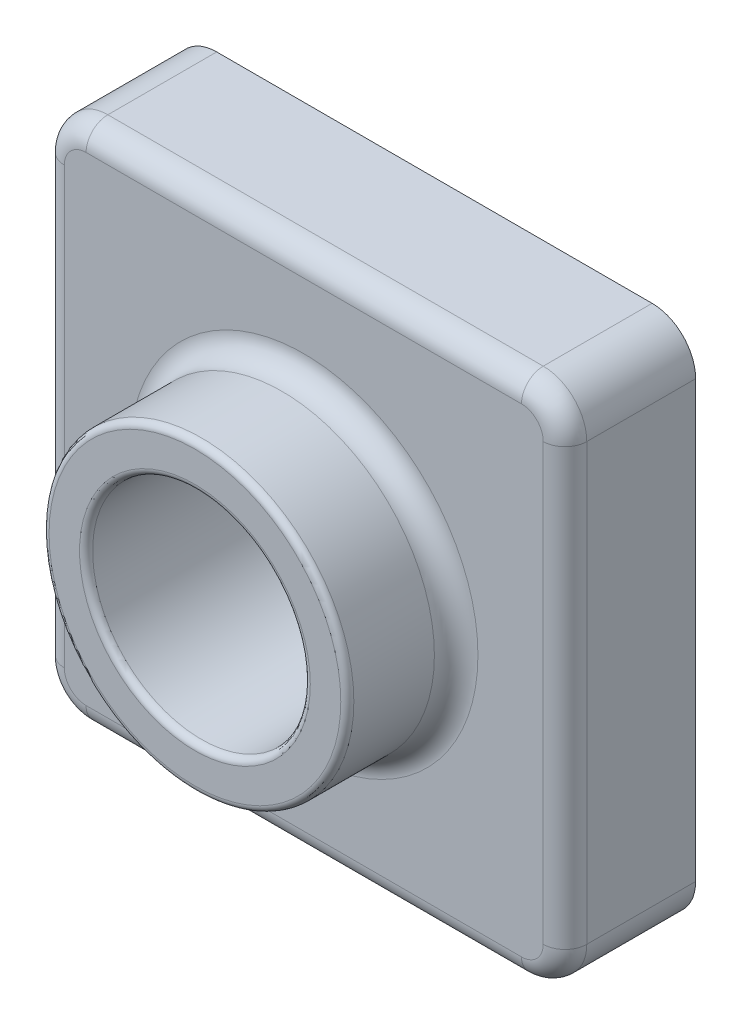
ISO-10303-21;
HEADER;
FILE_DESCRIPTION(('STEP AP214'),'2;1');
FILE_NAME('part.step','',(''),(''),'','','');
FILE_SCHEMA(('AUTOMOTIVE_DESIGN { 1 0 10303 214 1 1 1 1 }'));
ENDSEC;
DATA;
#1=APPLICATION_CONTEXT('core data for automotive mechanical design processes');
#2=APPLICATION_PROTOCOL_DEFINITION('international standard','automotive_design',2000,#1);
#3=PRODUCT_CONTEXT('',#1,'mechanical');
#4=PRODUCT('Part','Part','',(#3));
#5=PRODUCT_RELATED_PRODUCT_CATEGORY('part','',(#4));
#6=PRODUCT_DEFINITION_FORMATION('','',#4);
#7=PRODUCT_DEFINITION_CONTEXT('part definition',#1,'design');
#8=PRODUCT_DEFINITION('design','',#6,#7);
#9=PRODUCT_DEFINITION_SHAPE('','',#8);
#10=(LENGTH_UNIT() NAMED_UNIT(*) SI_UNIT(.MILLI.,.METRE.));
#11=(NAMED_UNIT(*) PLANE_ANGLE_UNIT() SI_UNIT($,.RADIAN.));
#12=(NAMED_UNIT(*) SI_UNIT($,.STERADIAN.) SOLID_ANGLE_UNIT());
#13=UNCERTAINTY_MEASURE_WITH_UNIT(LENGTH_MEASURE(1.E-05),#10,'distance_accuracy_value','');
#14=(GEOMETRIC_REPRESENTATION_CONTEXT(3) GLOBAL_UNCERTAINTY_ASSIGNED_CONTEXT((#13)) GLOBAL_UNIT_ASSIGNED_CONTEXT((#10,
#11,#12)) REPRESENTATION_CONTEXT('',''));
#15=CARTESIAN_POINT('',(0.,0.,0.));
#16=DIRECTION('',(0.,0.,1.));
#17=DIRECTION('',(1.,0.,0.));
#18=AXIS2_PLACEMENT_3D('',#15,#16,#17);
#19=CARTESIAN_POINT('',(0.,0.,0.));
#20=DIRECTION('',(0.,0.,1.));
#21=DIRECTION('',(1.,0.,0.));
#22=AXIS2_PLACEMENT_3D('',#19,#20,#21);
#23=PLANE('',#22);
#24=DIRECTION('',(-1.,0.,0.));
#25=VECTOR('',#24,1.);
#26=CARTESIAN_POINT('',(0.,120.,0.));
#27=LINE('',#26,#25);
#28=CARTESIAN_POINT('',(110.,120.,0.));
#29=VERTEX_POINT('',#28);
#30=CARTESIAN_POINT('',(10.,120.,0.));
#31=VERTEX_POINT('',#30);
#32=EDGE_CURVE('E326',#29,#31,#27,.T.);
#33=ORIENTED_EDGE('',*,*,#32,.F.);
#34=CARTESIAN_POINT('',(110.,110.,0.));
#35=DIRECTION('',(0.,0.,1.));
#36=DIRECTION('',(1.,0.,0.));
#37=AXIS2_PLACEMENT_3D('',#34,#35,#36);
#38=CIRCLE('',#37,10.);
#39=CARTESIAN_POINT('',(120.,110.,0.));
#40=VERTEX_POINT('',#39);
#41=EDGE_CURVE('E412',#29,#40,#38,.F.);
#42=ORIENTED_EDGE('',*,*,#41,.T.);
#43=DIRECTION('',(0.,1.,0.));
#44=VECTOR('',#43,1.);
#45=CARTESIAN_POINT('',(120.,120.,0.));
#46=LINE('',#45,#44);
#47=CARTESIAN_POINT('',(120.,9.99999999999999,0.));
#48=VERTEX_POINT('',#47);
#49=EDGE_CURVE('E322',#48,#40,#46,.T.);
#50=ORIENTED_EDGE('',*,*,#49,.F.);
#51=CARTESIAN_POINT('',(110.,9.99999999999999,0.));
#52=DIRECTION('',(0.,0.,1.));
#53=DIRECTION('',(1.,0.,0.));
#54=AXIS2_PLACEMENT_3D('',#51,#52,#53);
#55=CIRCLE('',#54,10.);
#56=CARTESIAN_POINT('',(110.,0.,0.));
#57=VERTEX_POINT('',#56);
#58=EDGE_CURVE('E403',#48,#57,#55,.F.);
#59=ORIENTED_EDGE('',*,*,#58,.T.);
#60=DIRECTION('',(1.,0.,0.));
#61=VECTOR('',#60,1.);
#62=CARTESIAN_POINT('',(0.,0.,0.));
#63=LINE('',#62,#61);
#64=CARTESIAN_POINT('',(10.,0.,0.));
#65=VERTEX_POINT('',#64);
#66=EDGE_CURVE('E318',#65,#57,#63,.T.);
#67=ORIENTED_EDGE('',*,*,#66,.F.);
#68=CARTESIAN_POINT('',(10.,10.,0.));
#69=DIRECTION('',(0.,0.,1.));
#70=DIRECTION('',(1.,0.,0.));
#71=AXIS2_PLACEMENT_3D('',#68,#69,#70);
#72=CIRCLE('',#71,10.);
#73=CARTESIAN_POINT('',(0.,9.99999999999999,0.));
#74=VERTEX_POINT('',#73);
#75=EDGE_CURVE('E406',#65,#74,#72,.F.);
#76=ORIENTED_EDGE('',*,*,#75,.T.);
#77=DIRECTION('',(0.,-1.,0.));
#78=VECTOR('',#77,1.);
#79=CARTESIAN_POINT('',(0.,120.,0.));
#80=LINE('',#79,#78);
#81=CARTESIAN_POINT('',(0.,110.,0.));
#82=VERTEX_POINT('',#81);
#83=EDGE_CURVE('E313',#82,#74,#80,.T.);
#84=ORIENTED_EDGE('',*,*,#83,.F.);
#85=CARTESIAN_POINT('',(10.,110.,0.));
#86=DIRECTION('',(0.,0.,1.));
#87=DIRECTION('',(1.,0.,0.));
#88=AXIS2_PLACEMENT_3D('',#85,#86,#87);
#89=CIRCLE('',#88,10.);
#90=EDGE_CURVE('E409',#82,#31,#89,.F.);
#91=ORIENTED_EDGE('',*,*,#90,.T.);
#92=EDGE_LOOP('',(#33,#42,#50,#59,#67,#76,#84,#91));
#93=FACE_BOUND('',#92,.T.);
#94=CARTESIAN_POINT('',(110.,110.,0.));
#95=DIRECTION('',(0.,0.,1.));
#96=DIRECTION('',(1.,0.,0.));
#97=AXIS2_PLACEMENT_3D('',#94,#95,#96);
#98=CIRCLE('',#97,8.);
#99=CARTESIAN_POINT('',(110.,118.,0.));
#100=VERTEX_POINT('',#99);
#101=CARTESIAN_POINT('',(118.,110.,0.));
#102=VERTEX_POINT('',#101);
#103=EDGE_CURVE('E274',#100,#102,#98,.F.);
#104=ORIENTED_EDGE('',*,*,#103,.F.);
#105=DIRECTION('',(-1.,0.,0.));
#106=VECTOR('',#105,1.);
#107=CARTESIAN_POINT('',(0.,118.,0.));
#108=LINE('',#107,#106);
#109=CARTESIAN_POINT('',(10.,118.,0.));
#110=VERTEX_POINT('',#109);
#111=EDGE_CURVE('E287',#100,#110,#108,.T.);
#112=ORIENTED_EDGE('',*,*,#111,.T.);
#113=CARTESIAN_POINT('',(10.,110.,0.));
#114=DIRECTION('',(0.,0.,1.));
#115=DIRECTION('',(1.,0.,0.));
#116=AXIS2_PLACEMENT_3D('',#113,#114,#115);
#117=CIRCLE('',#116,8.);
#118=CARTESIAN_POINT('',(2.,110.,0.));
#119=VERTEX_POINT('',#118);
#120=EDGE_CURVE('E283',#119,#110,#117,.F.);
#121=ORIENTED_EDGE('',*,*,#120,.F.);
#122=DIRECTION('',(0.,-1.,0.));
#123=VECTOR('',#122,1.);
#124=CARTESIAN_POINT('',(2.,120.,0.));
#125=LINE('',#124,#123);
#126=CARTESIAN_POINT('',(2.,9.99999999999999,0.));
#127=VERTEX_POINT('',#126);
#128=EDGE_CURVE('E57',#119,#127,#125,.T.);
#129=ORIENTED_EDGE('',*,*,#128,.T.);
#130=CARTESIAN_POINT('',(10.,10.,0.));
#131=DIRECTION('',(0.,0.,1.));
#132=DIRECTION('',(1.,0.,0.));
#133=AXIS2_PLACEMENT_3D('',#130,#131,#132);
#134=CIRCLE('',#133,8.);
#135=CARTESIAN_POINT('',(10.,2.,0.));
#136=VERTEX_POINT('',#135);
#137=EDGE_CURVE('E286',#136,#127,#134,.F.);
#138=ORIENTED_EDGE('',*,*,#137,.F.);
#139=DIRECTION('',(1.,0.,0.));
#140=VECTOR('',#139,1.);
#141=CARTESIAN_POINT('',(0.,2.,0.));
#142=LINE('',#141,#140);
#143=CARTESIAN_POINT('',(110.,2.,0.));
#144=VERTEX_POINT('',#143);
#145=EDGE_CURVE('E281',#136,#144,#142,.T.);
#146=ORIENTED_EDGE('',*,*,#145,.T.);
#147=CARTESIAN_POINT('',(110.,9.99999999999999,0.));
#148=DIRECTION('',(0.,0.,1.));
#149=DIRECTION('',(1.,0.,0.));
#150=AXIS2_PLACEMENT_3D('',#147,#148,#149);
#151=CIRCLE('',#150,8.);
#152=CARTESIAN_POINT('',(118.,9.99999999999999,0.));
#153=VERTEX_POINT('',#152);
#154=EDGE_CURVE('E268',#153,#144,#151,.F.);
#155=ORIENTED_EDGE('',*,*,#154,.F.);
#156=DIRECTION('',(0.,1.,0.));
#157=VECTOR('',#156,1.);
#158=CARTESIAN_POINT('',(118.,120.,0.));
#159=LINE('',#158,#157);
#160=EDGE_CURVE('E292',#153,#102,#159,.T.);
#161=ORIENTED_EDGE('',*,*,#160,.T.);
#162=EDGE_LOOP('',(#104,#112,#121,#129,#138,#146,#155,#161));
#163=FACE_BOUND('',#162,.T.);
#164=ADVANCED_FACE('F41',(#93,#163),#23,.F.);
#165=CARTESIAN_POINT('',(0.,120.,30.));
#166=DIRECTION('',(1.,0.,0.));
#167=DIRECTION('',(0.,0.,-1.));
#168=AXIS2_PLACEMENT_3D('',#165,#166,#167);
#169=PLANE('',#168);
#170=DIRECTION('',(0.,-1.,0.));
#171=VECTOR('',#170,1.);
#172=CARTESIAN_POINT('',(0.,120.,25.));
#173=LINE('',#172,#171);
#174=CARTESIAN_POINT('',(0.,10.,25.));
#175=VERTEX_POINT('',#174);
#176=CARTESIAN_POINT('',(0.,110.,25.));
#177=VERTEX_POINT('',#176);
#178=EDGE_CURVE('E65',#175,#177,#173,.F.);
#179=ORIENTED_EDGE('',*,*,#178,.T.);
#180=DIRECTION('',(0.,0.,-1.));
#181=VECTOR('',#180,1.);
#182=CARTESIAN_POINT('',(0.,110.,30.));
#183=LINE('',#182,#181);
#184=EDGE_CURVE('E396',#177,#82,#183,.T.);
#185=ORIENTED_EDGE('',*,*,#184,.T.);
#186=ORIENTED_EDGE('',*,*,#83,.T.);
#187=DIRECTION('',(0.,0.,-1.));
#188=VECTOR('',#187,1.);
#189=CARTESIAN_POINT('',(0.,9.99999999999999,30.));
#190=LINE('',#189,#188);
#191=EDGE_CURVE('E391',#74,#175,#190,.F.);
#192=ORIENTED_EDGE('',*,*,#191,.T.);
#193=EDGE_LOOP('',(#179,#185,#186,#192));
#194=FACE_BOUND('',#193,.T.);
#195=ADVANCED_FACE('F512',(#194),#169,.F.);
#196=CARTESIAN_POINT('',(0.,0.,30.));
#197=DIRECTION('',(0.,1.,0.));
#198=DIRECTION('',(0.,0.,1.));
#199=AXIS2_PLACEMENT_3D('',#196,#197,#198);
#200=PLANE('',#199);
#201=DIRECTION('',(1.,0.,0.));
#202=VECTOR('',#201,1.);
#203=CARTESIAN_POINT('',(0.,0.,25.));
#204=LINE('',#203,#202);
#205=CARTESIAN_POINT('',(110.,0.,25.));
#206=VERTEX_POINT('',#205);
#207=CARTESIAN_POINT('',(10.,0.,25.));
#208=VERTEX_POINT('',#207);
#209=EDGE_CURVE('E385',#206,#208,#204,.F.);
#210=ORIENTED_EDGE('',*,*,#209,.T.);
#211=DIRECTION('',(0.,0.,-1.));
#212=VECTOR('',#211,1.);
#213=CARTESIAN_POINT('',(10.,0.,30.));
#214=LINE('',#213,#212);
#215=EDGE_CURVE('E388',#208,#65,#214,.T.);
#216=ORIENTED_EDGE('',*,*,#215,.T.);
#217=ORIENTED_EDGE('',*,*,#66,.T.);
#218=DIRECTION('',(0.,0.,-1.));
#219=VECTOR('',#218,1.);
#220=CARTESIAN_POINT('',(110.,0.,30.));
#221=LINE('',#220,#219);
#222=EDGE_CURVE('E382',#57,#206,#221,.F.);
#223=ORIENTED_EDGE('',*,*,#222,.T.);
#224=EDGE_LOOP('',(#210,#216,#217,#223));
#225=FACE_BOUND('',#224,.T.);
#226=ADVANCED_FACE('F517',(#225),#200,.F.);
#227=CARTESIAN_POINT('',(120.,120.,30.));
#228=DIRECTION('',(-1.,0.,0.));
#229=DIRECTION('',(0.,0.,1.));
#230=AXIS2_PLACEMENT_3D('',#227,#228,#229);
#231=PLANE('',#230);
#232=ORIENTED_EDGE('',*,*,#49,.T.);
#233=DIRECTION('',(0.,0.,-1.));
#234=VECTOR('',#233,1.);
#235=CARTESIAN_POINT('',(120.,110.,30.));
#236=LINE('',#235,#234);
#237=CARTESIAN_POINT('',(120.,110.,25.));
#238=VERTEX_POINT('',#237);
#239=EDGE_CURVE('E379',#40,#238,#236,.F.);
#240=ORIENTED_EDGE('',*,*,#239,.T.);
#241=DIRECTION('',(0.,1.,0.));
#242=VECTOR('',#241,1.);
#243=CARTESIAN_POINT('',(120.,0.,25.));
#244=LINE('',#243,#242);
#245=CARTESIAN_POINT('',(120.,9.99999999999999,25.));
#246=VERTEX_POINT('',#245);
#247=EDGE_CURVE('E376',#238,#246,#244,.F.);
#248=ORIENTED_EDGE('',*,*,#247,.T.);
#249=DIRECTION('',(0.,0.,-1.));
#250=VECTOR('',#249,1.);
#251=CARTESIAN_POINT('',(120.,9.99999999999999,30.));
#252=LINE('',#251,#250);
#253=EDGE_CURVE('E373',#246,#48,#252,.T.);
#254=ORIENTED_EDGE('',*,*,#253,.T.);
#255=EDGE_LOOP('',(#232,#240,#248,#254));
#256=FACE_BOUND('',#255,.T.);
#257=ADVANCED_FACE('F962',(#256),#231,.F.);
#258=CARTESIAN_POINT('',(0.,120.,30.));
#259=DIRECTION('',(0.,-1.,0.));
#260=DIRECTION('',(0.,0.,-1.));
#261=AXIS2_PLACEMENT_3D('',#258,#259,#260);
#262=PLANE('',#261);
#263=DIRECTION('',(-1.,0.,0.));
#264=VECTOR('',#263,1.);
#265=CARTESIAN_POINT('',(120.,120.,25.));
#266=LINE('',#265,#264);
#267=CARTESIAN_POINT('',(10.,120.,25.));
#268=VERTEX_POINT('',#267);
#269=CARTESIAN_POINT('',(110.,120.,25.));
#270=VERTEX_POINT('',#269);
#271=EDGE_CURVE('E366',#268,#270,#266,.F.);
#272=ORIENTED_EDGE('',*,*,#271,.T.);
#273=DIRECTION('',(0.,0.,-1.));
#274=VECTOR('',#273,1.);
#275=CARTESIAN_POINT('',(110.,120.,30.));
#276=LINE('',#275,#274);
#277=EDGE_CURVE('E370',#270,#29,#276,.T.);
#278=ORIENTED_EDGE('',*,*,#277,.T.);
#279=ORIENTED_EDGE('',*,*,#32,.T.);
#280=DIRECTION('',(0.,0.,-1.));
#281=VECTOR('',#280,1.);
#282=CARTESIAN_POINT('',(10.,120.,30.));
#283=LINE('',#282,#281);
#284=EDGE_CURVE('E363',#31,#268,#283,.F.);
#285=ORIENTED_EDGE('',*,*,#284,.T.);
#286=EDGE_LOOP('',(#272,#278,#279,#285));
#287=FACE_BOUND('',#286,.T.);
#288=ADVANCED_FACE('F506',(#287),#262,.F.);
#289=CARTESIAN_POINT('',(0.,0.,30.));
#290=DIRECTION('',(0.,0.,1.));
#291=DIRECTION('',(1.,0.,0.));
#292=AXIS2_PLACEMENT_3D('',#289,#290,#291);
#293=PLANE('',#292);
#294=CARTESIAN_POINT('',(110.,9.99999999999999,30.));
#295=DIRECTION('',(0.,0.,1.));
#296=DIRECTION('',(1.,0.,0.));
#297=AXIS2_PLACEMENT_3D('',#294,#295,#296);
#298=CIRCLE('',#297,5.);
#299=CARTESIAN_POINT('',(115.,9.99999999999999,30.));
#300=VERTEX_POINT('',#299);
#301=CARTESIAN_POINT('',(110.,5.,30.));
#302=VERTEX_POINT('',#301);
#303=EDGE_CURVE('E352',#300,#302,#298,.F.);
#304=ORIENTED_EDGE('',*,*,#303,.F.);
#305=DIRECTION('',(0.,1.,0.));
#306=VECTOR('',#305,1.);
#307=CARTESIAN_POINT('',(115.,120.,30.));
#308=LINE('',#307,#306);
#309=CARTESIAN_POINT('',(115.,110.,30.));
#310=VERTEX_POINT('',#309);
#311=EDGE_CURVE('E360',#300,#310,#308,.T.);
#312=ORIENTED_EDGE('',*,*,#311,.T.);
#313=CARTESIAN_POINT('',(110.,110.,30.));
#314=DIRECTION('',(0.,0.,1.));
#315=DIRECTION('',(1.,0.,0.));
#316=AXIS2_PLACEMENT_3D('',#313,#314,#315);
#317=CIRCLE('',#316,5.);
#318=CARTESIAN_POINT('',(110.,115.,30.));
#319=VERTEX_POINT('',#318);
#320=EDGE_CURVE('E356',#319,#310,#317,.F.);
#321=ORIENTED_EDGE('',*,*,#320,.F.);
#322=DIRECTION('',(-1.,0.,0.));
#323=VECTOR('',#322,1.);
#324=CARTESIAN_POINT('',(0.,115.,30.));
#325=LINE('',#324,#323);
#326=CARTESIAN_POINT('',(10.,115.,30.));
#327=VERTEX_POINT('',#326);
#328=EDGE_CURVE('E348',#319,#327,#325,.T.);
#329=ORIENTED_EDGE('',*,*,#328,.T.);
#330=CARTESIAN_POINT('',(10.,110.,30.));
#331=DIRECTION('',(0.,0.,1.));
#332=DIRECTION('',(1.,0.,0.));
#333=AXIS2_PLACEMENT_3D('',#330,#331,#332);
#334=CIRCLE('',#333,5.);
#335=CARTESIAN_POINT('',(5.,110.,30.));
#336=VERTEX_POINT('',#335);
#337=EDGE_CURVE('E344',#336,#327,#334,.F.);
#338=ORIENTED_EDGE('',*,*,#337,.F.);
#339=DIRECTION('',(0.,-1.,0.));
#340=VECTOR('',#339,1.);
#341=CARTESIAN_POINT('',(5.,0.,30.));
#342=LINE('',#341,#340);
#343=CARTESIAN_POINT('',(5.,10.,30.));
#344=VERTEX_POINT('',#343);
#345=EDGE_CURVE('E338',#336,#344,#342,.T.);
#346=ORIENTED_EDGE('',*,*,#345,.T.);
#347=CARTESIAN_POINT('',(10.,10.,30.));
#348=DIRECTION('',(0.,0.,1.));
#349=DIRECTION('',(1.,0.,0.));
#350=AXIS2_PLACEMENT_3D('',#347,#348,#349);
#351=CIRCLE('',#350,5.);
#352=CARTESIAN_POINT('',(10.,5.,30.));
#353=VERTEX_POINT('',#352);
#354=EDGE_CURVE('E334',#353,#344,#351,.F.);
#355=ORIENTED_EDGE('',*,*,#354,.F.);
#356=DIRECTION('',(1.,0.,0.));
#357=VECTOR('',#356,1.);
#358=CARTESIAN_POINT('',(120.,5.,30.));
#359=LINE('',#358,#357);
#360=EDGE_CURVE('E341',#353,#302,#359,.T.);
#361=ORIENTED_EDGE('',*,*,#360,.T.);
#362=EDGE_LOOP('',(#304,#312,#321,#329,#338,#346,#355,#361));
#363=FACE_BOUND('',#362,.T.);
#364=CARTESIAN_POINT('',(60.,60.,30.));
#365=DIRECTION('',(0.,0.,1.));
#366=DIRECTION('',(1.,0.,0.));
#367=AXIS2_PLACEMENT_3D('',#364,#365,#366);
#368=CIRCLE('',#367,40.);
#369=CARTESIAN_POINT('',(100.,60.,30.));
#370=VERTEX_POINT('',#369);
#371=EDGE_CURVE('E330',#370,#370,#368,.F.);
#372=ORIENTED_EDGE('',*,*,#371,.T.);
#373=EDGE_LOOP('',(#372));
#374=FACE_BOUND('',#373,.T.);
#375=ADVANCED_FACE('F498',(#363,#374),#293,.T.);
#376=CARTESIAN_POINT('',(60.,60.,0.));
#377=DIRECTION('',(0.,0.,1.));
#378=DIRECTION('',(1.,0.,0.));
#379=AXIS2_PLACEMENT_3D('',#376,#377,#378);
#380=CIRCLE('',#379,27.);
#381=CARTESIAN_POINT('',(87.,60.,0.));
#382=VERTEX_POINT('',#381);
#383=EDGE_CURVE('E282',#382,#382,#380,.T.);
#384=ORIENTED_EDGE('',*,*,#383,.F.);
#385=EDGE_LOOP('',(#384));
#386=FACE_BOUND('',#385,.T.);
#387=CARTESIAN_POINT('',(60.,60.,0.));
#388=DIRECTION('',(0.,0.,1.));
#389=DIRECTION('',(1.,0.,0.));
#390=AXIS2_PLACEMENT_3D('',#387,#388,#389);
#391=CIRCLE('',#390,25.);
#392=CARTESIAN_POINT('',(85.,60.,0.));
#393=VERTEX_POINT('',#392);
#394=EDGE_CURVE('E309',#393,#393,#391,.T.);
#395=ORIENTED_EDGE('',*,*,#394,.T.);
#396=EDGE_LOOP('',(#395));
#397=FACE_BOUND('',#396,.T.);
#398=ADVANCED_FACE('F496',(#386,#397),#23,.F.);
#399=CARTESIAN_POINT('',(60.,60.,55.));
#400=DIRECTION('',(0.,0.,-1.));
#401=DIRECTION('',(-1.,0.,0.));
#402=AXIS2_PLACEMENT_3D('',#399,#400,#401);
#403=CYLINDRICAL_SURFACE('',#402,35.);
#404=CARTESIAN_POINT('',(60.,60.,53.5));
#405=DIRECTION('',(0.,0.,1.));
#406=DIRECTION('',(1.,0.,0.));
#407=AXIS2_PLACEMENT_3D('',#404,#405,#406);
#408=CIRCLE('',#407,35.);
#409=CARTESIAN_POINT('',(95.,60.,53.5));
#410=VERTEX_POINT('',#409);
#411=EDGE_CURVE('E50',#410,#410,#408,.F.);
#412=ORIENTED_EDGE('',*,*,#411,.T.);
#413=EDGE_LOOP('',(#412));
#414=FACE_BOUND('',#413,.T.);
#415=CARTESIAN_POINT('',(60.,60.,35.));
#416=DIRECTION('',(0.,0.,1.));
#417=DIRECTION('',(1.,0.,0.));
#418=AXIS2_PLACEMENT_3D('',#415,#416,#417);
#419=CIRCLE('',#418,35.);
#420=CARTESIAN_POINT('',(95.,60.,35.));
#421=VERTEX_POINT('',#420);
#422=EDGE_CURVE('E399',#421,#421,#419,.T.);
#423=ORIENTED_EDGE('',*,*,#422,.T.);
#424=EDGE_LOOP('',(#423));
#425=FACE_BOUND('',#424,.T.);
#426=ADVANCED_FACE('F470',(#414,#425),#403,.T.);
#427=CARTESIAN_POINT('',(60.,60.,55.));
#428=DIRECTION('',(0.,0.,1.));
#429=DIRECTION('',(1.,0.,0.));
#430=AXIS2_PLACEMENT_3D('',#427,#428,#429);
#431=PLANE('',#430);
#432=CARTESIAN_POINT('',(60.,60.,55.));
#433=DIRECTION('',(0.,0.,1.));
#434=DIRECTION('',(1.,0.,0.));
#435=AXIS2_PLACEMENT_3D('',#432,#433,#434);
#436=CIRCLE('',#435,33.5);
#437=CARTESIAN_POINT('',(93.5,60.,55.));
#438=VERTEX_POINT('',#437);
#439=EDGE_CURVE('E463',#438,#438,#436,.T.);
#440=ORIENTED_EDGE('',*,*,#439,.T.);
#441=EDGE_LOOP('',(#440));
#442=FACE_BOUND('',#441,.T.);
#443=CARTESIAN_POINT('',(60.,60.,55.));
#444=DIRECTION('',(0.,0.,1.));
#445=DIRECTION('',(1.,0.,0.));
#446=AXIS2_PLACEMENT_3D('',#443,#444,#445);
#447=CIRCLE('',#446,26.5);
#448=CARTESIAN_POINT('',(86.5,60.,55.));
#449=VERTEX_POINT('',#448);
#450=EDGE_CURVE('E415',#449,#449,#447,.F.);
#451=ORIENTED_EDGE('',*,*,#450,.T.);
#452=EDGE_LOOP('',(#451));
#453=FACE_BOUND('',#452,.T.);
#454=ADVANCED_FACE('F479',(#442,#453),#431,.T.);
#455=CARTESIAN_POINT('',(60.,60.,0.));
#456=DIRECTION('',(0.,0.,1.));
#457=DIRECTION('',(1.,0.,0.));
#458=AXIS2_PLACEMENT_3D('',#455,#456,#457);
#459=CYLINDRICAL_SURFACE('',#458,25.);
#460=CARTESIAN_POINT('',(60.,60.,53.5));
#461=DIRECTION('',(0.,0.,1.));
#462=DIRECTION('',(1.,0.,0.));
#463=AXIS2_PLACEMENT_3D('',#460,#461,#462);
#464=CIRCLE('',#463,25.);
#465=CARTESIAN_POINT('',(85.,60.,53.5));
#466=VERTEX_POINT('',#465);
#467=EDGE_CURVE('E12',#466,#466,#464,.T.);
#468=ORIENTED_EDGE('',*,*,#467,.T.);
#469=EDGE_LOOP('',(#468));
#470=FACE_BOUND('',#469,.T.);
#471=ORIENTED_EDGE('',*,*,#394,.F.);
#472=EDGE_LOOP('',(#471));
#473=FACE_BOUND('',#472,.T.);
#474=ADVANCED_FACE('F482',(#470,#473),#459,.F.);
#475=CARTESIAN_POINT('',(110.,9.99999999999999,30.));
#476=DIRECTION('',(0.,0.,-1.));
#477=DIRECTION('',(-1.,0.,0.));
#478=AXIS2_PLACEMENT_3D('',#475,#476,#477);
#479=CYLINDRICAL_SURFACE('',#478,10.);
#480=ORIENTED_EDGE('',*,*,#58,.F.);
#481=ORIENTED_EDGE('',*,*,#253,.F.);
#482=CARTESIAN_POINT('',(110.,9.99999999999999,25.));
#483=DIRECTION('',(0.,0.,1.));
#484=DIRECTION('',(1.,0.,0.));
#485=AXIS2_PLACEMENT_3D('',#482,#483,#484);
#486=CIRCLE('',#485,10.);
#487=EDGE_CURVE('E314',#206,#246,#486,.T.);
#488=ORIENTED_EDGE('',*,*,#487,.F.);
#489=ORIENTED_EDGE('',*,*,#222,.F.);
#490=EDGE_LOOP('',(#480,#481,#488,#489));
#491=FACE_BOUND('',#490,.T.);
#492=ADVANCED_FACE('F492',(#491),#479,.T.);
#493=CARTESIAN_POINT('',(0.,5.,25.));
#494=DIRECTION('',(-1.,0.,0.));
#495=DIRECTION('',(0.,0.,1.));
#496=AXIS2_PLACEMENT_3D('',#493,#494,#495);
#497=CYLINDRICAL_SURFACE('',#496,5.);
#498=CARTESIAN_POINT('',(10.,5.,25.));
#499=DIRECTION('',(-1.,0.,0.));
#500=DIRECTION('',(0.,0.,1.));
#501=AXIS2_PLACEMENT_3D('',#498,#499,#500);
#502=CIRCLE('',#501,5.);
#503=EDGE_CURVE('E449',#208,#353,#502,.T.);
#504=ORIENTED_EDGE('',*,*,#503,.F.);
#505=ORIENTED_EDGE('',*,*,#209,.F.);
#506=CARTESIAN_POINT('',(110.,5.,25.));
#507=DIRECTION('',(1.,0.,0.));
#508=DIRECTION('',(0.,0.,-1.));
#509=AXIS2_PLACEMENT_3D('',#506,#507,#508);
#510=CIRCLE('',#509,5.);
#511=EDGE_CURVE('E453',#302,#206,#510,.T.);
#512=ORIENTED_EDGE('',*,*,#511,.F.);
#513=ORIENTED_EDGE('',*,*,#360,.F.);
#514=EDGE_LOOP('',(#504,#505,#512,#513));
#515=FACE_BOUND('',#514,.T.);
#516=ADVANCED_FACE('F931',(#515),#497,.T.);
#517=CARTESIAN_POINT('',(10.,10.,30.));
#518=DIRECTION('',(0.,0.,-1.));
#519=DIRECTION('',(-1.,0.,0.));
#520=AXIS2_PLACEMENT_3D('',#517,#518,#519);
#521=CYLINDRICAL_SURFACE('',#520,10.);
#522=ORIENTED_EDGE('',*,*,#75,.F.);
#523=ORIENTED_EDGE('',*,*,#215,.F.);
#524=CARTESIAN_POINT('',(10.,10.,25.));
#525=DIRECTION('',(0.,0.,1.));
#526=DIRECTION('',(1.,0.,0.));
#527=AXIS2_PLACEMENT_3D('',#524,#525,#526);
#528=CIRCLE('',#527,10.);
#529=EDGE_CURVE('E445',#175,#208,#528,.T.);
#530=ORIENTED_EDGE('',*,*,#529,.F.);
#531=ORIENTED_EDGE('',*,*,#191,.F.);
#532=EDGE_LOOP('',(#522,#523,#530,#531));
#533=FACE_BOUND('',#532,.T.);
#534=ADVANCED_FACE('F921',(#533),#521,.T.);
#535=CARTESIAN_POINT('',(110.,9.99999999999999,25.));
#536=DIRECTION('',(0.,0.,1.));
#537=DIRECTION('',(1.,0.,0.));
#538=AXIS2_PLACEMENT_3D('',#535,#536,#537);
#539=DEGENERATE_TOROIDAL_SURFACE('',#538,5.,5.,.T.);
#540=ORIENTED_EDGE('',*,*,#511,.T.);
#541=ORIENTED_EDGE('',*,*,#487,.T.);
#542=CARTESIAN_POINT('',(115.,9.99999999999999,25.));
#543=DIRECTION('',(0.,-1.,0.));
#544=DIRECTION('',(0.,0.,-1.));
#545=AXIS2_PLACEMENT_3D('',#542,#543,#544);
#546=CIRCLE('',#545,5.);
#547=EDGE_CURVE('E441',#300,#246,#546,.F.);
#548=ORIENTED_EDGE('',*,*,#547,.F.);
#549=ORIENTED_EDGE('',*,*,#303,.T.);
#550=EDGE_LOOP('',(#540,#541,#548,#549));
#551=FACE_BOUND('',#550,.T.);
#552=ADVANCED_FACE('F911',(#551),#539,.T.);
#553=CARTESIAN_POINT('',(10.,10.,25.));
#554=DIRECTION('',(0.,0.,1.));
#555=DIRECTION('',(1.,0.,0.));
#556=AXIS2_PLACEMENT_3D('',#553,#554,#555);
#557=DEGENERATE_TOROIDAL_SURFACE('',#556,5.,5.,.T.);
#558=ORIENTED_EDGE('',*,*,#503,.T.);
#559=ORIENTED_EDGE('',*,*,#354,.T.);
#560=CARTESIAN_POINT('',(5.,10.,25.));
#561=DIRECTION('',(0.,-1.,0.));
#562=DIRECTION('',(0.,0.,-1.));
#563=AXIS2_PLACEMENT_3D('',#560,#561,#562);
#564=CIRCLE('',#563,5.);
#565=EDGE_CURVE('E437',#175,#344,#564,.F.);
#566=ORIENTED_EDGE('',*,*,#565,.F.);
#567=ORIENTED_EDGE('',*,*,#529,.T.);
#568=EDGE_LOOP('',(#558,#559,#566,#567));
#569=FACE_BOUND('',#568,.T.);
#570=ADVANCED_FACE('F901',(#569),#557,.T.);
#571=CARTESIAN_POINT('',(110.,110.,30.));
#572=DIRECTION('',(0.,0.,-1.));
#573=DIRECTION('',(-1.,0.,0.));
#574=AXIS2_PLACEMENT_3D('',#571,#572,#573);
#575=CYLINDRICAL_SURFACE('',#574,10.);
#576=ORIENTED_EDGE('',*,*,#41,.F.);
#577=ORIENTED_EDGE('',*,*,#277,.F.);
#578=CARTESIAN_POINT('',(110.,110.,25.));
#579=DIRECTION('',(0.,0.,1.));
#580=DIRECTION('',(1.,0.,0.));
#581=AXIS2_PLACEMENT_3D('',#578,#579,#580);
#582=CIRCLE('',#581,10.);
#583=EDGE_CURVE('E433',#238,#270,#582,.T.);
#584=ORIENTED_EDGE('',*,*,#583,.F.);
#585=ORIENTED_EDGE('',*,*,#239,.F.);
#586=EDGE_LOOP('',(#576,#577,#584,#585));
#587=FACE_BOUND('',#586,.T.);
#588=ADVANCED_FACE('F891',(#587),#575,.T.);
#589=CARTESIAN_POINT('',(115.,0.,25.));
#590=DIRECTION('',(0.,-1.,0.));
#591=DIRECTION('',(0.,0.,-1.));
#592=AXIS2_PLACEMENT_3D('',#589,#590,#591);
#593=CYLINDRICAL_SURFACE('',#592,5.);
#594=ORIENTED_EDGE('',*,*,#547,.T.);
#595=ORIENTED_EDGE('',*,*,#247,.F.);
#596=CARTESIAN_POINT('',(115.,110.,25.));
#597=DIRECTION('',(0.,1.,0.));
#598=DIRECTION('',(0.,0.,1.));
#599=AXIS2_PLACEMENT_3D('',#596,#597,#598);
#600=CIRCLE('',#599,5.);
#601=EDGE_CURVE('E429',#310,#238,#600,.T.);
#602=ORIENTED_EDGE('',*,*,#601,.F.);
#603=ORIENTED_EDGE('',*,*,#311,.F.);
#604=EDGE_LOOP('',(#594,#595,#602,#603));
#605=FACE_BOUND('',#604,.T.);
#606=ADVANCED_FACE('F881',(#605),#593,.T.);
#607=CARTESIAN_POINT('',(5.,0.,25.));
#608=DIRECTION('',(0.,1.,0.));
#609=DIRECTION('',(0.,0.,1.));
#610=AXIS2_PLACEMENT_3D('',#607,#608,#609);
#611=CYLINDRICAL_SURFACE('',#610,5.);
#612=ORIENTED_EDGE('',*,*,#565,.T.);
#613=ORIENTED_EDGE('',*,*,#345,.F.);
#614=CARTESIAN_POINT('',(5.,110.,25.));
#615=DIRECTION('',(0.,1.,0.));
#616=DIRECTION('',(0.,0.,1.));
#617=AXIS2_PLACEMENT_3D('',#614,#615,#616);
#618=CIRCLE('',#617,5.);
#619=EDGE_CURVE('E425',#177,#336,#618,.T.);
#620=ORIENTED_EDGE('',*,*,#619,.F.);
#621=ORIENTED_EDGE('',*,*,#178,.F.);
#622=EDGE_LOOP('',(#612,#613,#620,#621));
#623=FACE_BOUND('',#622,.T.);
#624=ADVANCED_FACE('F871',(#623),#611,.T.);
#625=CARTESIAN_POINT('',(10.,110.,30.));
#626=DIRECTION('',(0.,0.,-1.));
#627=DIRECTION('',(-1.,0.,0.));
#628=AXIS2_PLACEMENT_3D('',#625,#626,#627);
#629=CYLINDRICAL_SURFACE('',#628,10.);
#630=ORIENTED_EDGE('',*,*,#90,.F.);
#631=ORIENTED_EDGE('',*,*,#184,.F.);
#632=CARTESIAN_POINT('',(10.,110.,25.));
#633=DIRECTION('',(0.,0.,1.));
#634=DIRECTION('',(1.,0.,0.));
#635=AXIS2_PLACEMENT_3D('',#632,#633,#634);
#636=CIRCLE('',#635,10.);
#637=EDGE_CURVE('E421',#268,#177,#636,.T.);
#638=ORIENTED_EDGE('',*,*,#637,.F.);
#639=ORIENTED_EDGE('',*,*,#284,.F.);
#640=EDGE_LOOP('',(#630,#631,#638,#639));
#641=FACE_BOUND('',#640,.T.);
#642=ADVANCED_FACE('F861',(#641),#629,.T.);
#643=CARTESIAN_POINT('',(110.,110.,25.));
#644=DIRECTION('',(0.,0.,1.));
#645=DIRECTION('',(1.,0.,0.));
#646=AXIS2_PLACEMENT_3D('',#643,#644,#645);
#647=DEGENERATE_TOROIDAL_SURFACE('',#646,5.,5.,.T.);
#648=ORIENTED_EDGE('',*,*,#601,.T.);
#649=ORIENTED_EDGE('',*,*,#583,.T.);
#650=CARTESIAN_POINT('',(110.,115.,25.));
#651=DIRECTION('',(1.,0.,0.));
#652=DIRECTION('',(0.,0.,-1.));
#653=AXIS2_PLACEMENT_3D('',#650,#651,#652);
#654=CIRCLE('',#653,5.);
#655=EDGE_CURVE('E418',#319,#270,#654,.F.);
#656=ORIENTED_EDGE('',*,*,#655,.F.);
#657=ORIENTED_EDGE('',*,*,#320,.T.);
#658=EDGE_LOOP('',(#648,#649,#656,#657));
#659=FACE_BOUND('',#658,.T.);
#660=ADVANCED_FACE('F851',(#659),#647,.T.);
#661=CARTESIAN_POINT('',(10.,110.,25.));
#662=DIRECTION('',(0.,0.,1.));
#663=DIRECTION('',(1.,0.,0.));
#664=AXIS2_PLACEMENT_3D('',#661,#662,#663);
#665=DEGENERATE_TOROIDAL_SURFACE('',#664,5.,5.,.T.);
#666=ORIENTED_EDGE('',*,*,#619,.T.);
#667=ORIENTED_EDGE('',*,*,#337,.T.);
#668=CARTESIAN_POINT('',(10.,115.,25.));
#669=DIRECTION('',(-1.,0.,0.));
#670=DIRECTION('',(0.,0.,1.));
#671=AXIS2_PLACEMENT_3D('',#668,#669,#670);
#672=CIRCLE('',#671,5.);
#673=EDGE_CURVE('E278',#268,#327,#672,.F.);
#674=ORIENTED_EDGE('',*,*,#673,.F.);
#675=ORIENTED_EDGE('',*,*,#637,.T.);
#676=EDGE_LOOP('',(#666,#667,#674,#675));
#677=FACE_BOUND('',#676,.T.);
#678=ADVANCED_FACE('F841',(#677),#665,.T.);
#679=CARTESIAN_POINT('',(0.,115.,25.));
#680=DIRECTION('',(1.,0.,0.));
#681=DIRECTION('',(0.,0.,-1.));
#682=AXIS2_PLACEMENT_3D('',#679,#680,#681);
#683=CYLINDRICAL_SURFACE('',#682,5.);
#684=ORIENTED_EDGE('',*,*,#655,.T.);
#685=ORIENTED_EDGE('',*,*,#271,.F.);
#686=ORIENTED_EDGE('',*,*,#673,.T.);
#687=ORIENTED_EDGE('',*,*,#328,.F.);
#688=EDGE_LOOP('',(#684,#685,#686,#687));
#689=FACE_BOUND('',#688,.T.);
#690=ADVANCED_FACE('F831',(#689),#683,.T.);
#691=CARTESIAN_POINT('',(60.,60.,35.));
#692=DIRECTION('',(0.,0.,1.));
#693=DIRECTION('',(1.,0.,0.));
#694=AXIS2_PLACEMENT_3D('',#691,#692,#693);
#695=TOROIDAL_SURFACE('',#694,40.,5.);
#696=ORIENTED_EDGE('',*,*,#371,.F.);
#697=EDGE_LOOP('',(#696));
#698=FACE_BOUND('',#697,.T.);
#699=ORIENTED_EDGE('',*,*,#422,.F.);
#700=EDGE_LOOP('',(#699));
#701=FACE_BOUND('',#700,.T.);
#702=ADVANCED_FACE('F476',(#698,#701),#695,.F.);
#703=CARTESIAN_POINT('',(60.,60.,53.5));
#704=DIRECTION('',(0.,0.,1.));
#705=DIRECTION('',(1.,0.,0.));
#706=AXIS2_PLACEMENT_3D('',#703,#704,#705);
#707=TOROIDAL_SURFACE('',#706,33.5,1.5);
#708=ORIENTED_EDGE('',*,*,#411,.F.);
#709=EDGE_LOOP('',(#708));
#710=FACE_BOUND('',#709,.T.);
#711=ORIENTED_EDGE('',*,*,#439,.F.);
#712=EDGE_LOOP('',(#711));
#713=FACE_BOUND('',#712,.T.);
#714=ADVANCED_FACE('F473',(#710,#713),#707,.T.);
#715=CARTESIAN_POINT('',(60.,60.,53.5));
#716=DIRECTION('',(0.,0.,1.));
#717=DIRECTION('',(1.,0.,0.));
#718=AXIS2_PLACEMENT_3D('',#715,#716,#717);
#719=TOROIDAL_SURFACE('',#718,26.5,1.5);
#720=ORIENTED_EDGE('',*,*,#450,.F.);
#721=EDGE_LOOP('',(#720));
#722=FACE_BOUND('',#721,.T.);
#723=ORIENTED_EDGE('',*,*,#467,.F.);
#724=EDGE_LOOP('',(#723));
#725=FACE_BOUND('',#724,.T.);
#726=ADVANCED_FACE('F43',(#722,#725),#719,.T.);
#727=CARTESIAN_POINT('',(2.,120.,30.));
#728=DIRECTION('',(1.,0.,0.));
#729=DIRECTION('',(0.,0.,-1.));
#730=AXIS2_PLACEMENT_3D('',#727,#728,#729);
#731=PLANE('',#730);
#732=DIRECTION('',(0.,1.,0.));
#733=VECTOR('',#732,1.);
#734=CARTESIAN_POINT('',(2.,120.,25.));
#735=LINE('',#734,#733);
#736=CARTESIAN_POINT('',(2.,9.99999999999999,25.));
#737=VERTEX_POINT('',#736);
#738=CARTESIAN_POINT('',(2.,110.,25.));
#739=VERTEX_POINT('',#738);
#740=EDGE_CURVE('E206',#737,#739,#735,.T.);
#741=ORIENTED_EDGE('',*,*,#740,.F.);
#742=DIRECTION('',(0.,0.,-1.));
#743=VECTOR('',#742,1.);
#744=CARTESIAN_POINT('',(2.,9.99999999999999,30.));
#745=LINE('',#744,#743);
#746=EDGE_CURVE('E214',#127,#737,#745,.F.);
#747=ORIENTED_EDGE('',*,*,#746,.F.);
#748=ORIENTED_EDGE('',*,*,#128,.F.);
#749=DIRECTION('',(0.,0.,-1.));
#750=VECTOR('',#749,1.);
#751=CARTESIAN_POINT('',(2.,110.,30.));
#752=LINE('',#751,#750);
#753=EDGE_CURVE('E213',#739,#119,#752,.T.);
#754=ORIENTED_EDGE('',*,*,#753,.F.);
#755=EDGE_LOOP('',(#741,#747,#748,#754));
#756=FACE_BOUND('',#755,.T.);
#757=ADVANCED_FACE('F216',(#756),#731,.T.);
#758=CARTESIAN_POINT('',(0.,2.,30.));
#759=DIRECTION('',(0.,1.,0.));
#760=DIRECTION('',(0.,0.,1.));
#761=AXIS2_PLACEMENT_3D('',#758,#759,#760);
#762=PLANE('',#761);
#763=DIRECTION('',(1.,0.,0.));
#764=VECTOR('',#763,1.);
#765=CARTESIAN_POINT('',(0.,2.,25.));
#766=LINE('',#765,#764);
#767=CARTESIAN_POINT('',(110.,2.,25.));
#768=VERTEX_POINT('',#767);
#769=CARTESIAN_POINT('',(10.,2.,25.));
#770=VERTEX_POINT('',#769);
#771=EDGE_CURVE('E542',#768,#770,#766,.F.);
#772=ORIENTED_EDGE('',*,*,#771,.F.);
#773=DIRECTION('',(0.,0.,1.));
#774=VECTOR('',#773,1.);
#775=CARTESIAN_POINT('',(110.,2.,30.));
#776=LINE('',#775,#774);
#777=EDGE_CURVE('E538',#144,#768,#776,.T.);
#778=ORIENTED_EDGE('',*,*,#777,.F.);
#779=ORIENTED_EDGE('',*,*,#145,.F.);
#780=DIRECTION('',(0.,0.,1.));
#781=VECTOR('',#780,1.);
#782=CARTESIAN_POINT('',(10.,2.,30.));
#783=LINE('',#782,#781);
#784=EDGE_CURVE('E601',#770,#136,#783,.F.);
#785=ORIENTED_EDGE('',*,*,#784,.F.);
#786=EDGE_LOOP('',(#772,#778,#779,#785));
#787=FACE_BOUND('',#786,.T.);
#788=ADVANCED_FACE('F640',(#787),#762,.T.);
#789=CARTESIAN_POINT('',(118.,120.,30.));
#790=DIRECTION('',(-1.,0.,0.));
#791=DIRECTION('',(0.,0.,1.));
#792=AXIS2_PLACEMENT_3D('',#789,#790,#791);
#793=PLANE('',#792);
#794=ORIENTED_EDGE('',*,*,#160,.F.);
#795=DIRECTION('',(0.,0.,1.));
#796=VECTOR('',#795,1.);
#797=CARTESIAN_POINT('',(118.,9.99999999999999,30.));
#798=LINE('',#797,#796);
#799=CARTESIAN_POINT('',(118.,9.99999999999999,25.));
#800=VERTEX_POINT('',#799);
#801=EDGE_CURVE('E255',#800,#153,#798,.F.);
#802=ORIENTED_EDGE('',*,*,#801,.F.);
#803=DIRECTION('',(0.,1.,0.));
#804=VECTOR('',#803,1.);
#805=CARTESIAN_POINT('',(118.,120.,25.));
#806=LINE('',#805,#804);
#807=CARTESIAN_POINT('',(118.,110.,25.));
#808=VERTEX_POINT('',#807);
#809=EDGE_CURVE('E535',#808,#800,#806,.F.);
#810=ORIENTED_EDGE('',*,*,#809,.F.);
#811=DIRECTION('',(0.,0.,1.));
#812=VECTOR('',#811,1.);
#813=CARTESIAN_POINT('',(118.,110.,30.));
#814=LINE('',#813,#812);
#815=EDGE_CURVE('E529',#102,#808,#814,.T.);
#816=ORIENTED_EDGE('',*,*,#815,.F.);
#817=EDGE_LOOP('',(#794,#802,#810,#816));
#818=FACE_BOUND('',#817,.T.);
#819=ADVANCED_FACE('F533',(#818),#793,.T.);
#820=CARTESIAN_POINT('',(0.,118.,30.));
#821=DIRECTION('',(0.,-1.,0.));
#822=DIRECTION('',(0.,0.,-1.));
#823=AXIS2_PLACEMENT_3D('',#820,#821,#822);
#824=PLANE('',#823);
#825=DIRECTION('',(1.,0.,0.));
#826=VECTOR('',#825,1.);
#827=CARTESIAN_POINT('',(0.,118.,25.));
#828=LINE('',#827,#826);
#829=CARTESIAN_POINT('',(10.,118.,25.));
#830=VERTEX_POINT('',#829);
#831=CARTESIAN_POINT('',(110.,118.,25.));
#832=VERTEX_POINT('',#831);
#833=EDGE_CURVE('E247',#830,#832,#828,.T.);
#834=ORIENTED_EDGE('',*,*,#833,.F.);
#835=DIRECTION('',(0.,0.,-1.));
#836=VECTOR('',#835,1.);
#837=CARTESIAN_POINT('',(10.,118.,30.));
#838=LINE('',#837,#836);
#839=EDGE_CURVE('E236',#110,#830,#838,.F.);
#840=ORIENTED_EDGE('',*,*,#839,.F.);
#841=ORIENTED_EDGE('',*,*,#111,.F.);
#842=DIRECTION('',(0.,0.,-1.));
#843=VECTOR('',#842,1.);
#844=CARTESIAN_POINT('',(110.,118.,30.));
#845=LINE('',#844,#843);
#846=EDGE_CURVE('E252',#832,#100,#845,.T.);
#847=ORIENTED_EDGE('',*,*,#846,.F.);
#848=EDGE_LOOP('',(#834,#840,#841,#847));
#849=FACE_BOUND('',#848,.T.);
#850=ADVANCED_FACE('F631',(#849),#824,.T.);
#851=CARTESIAN_POINT('',(0.,0.,28.));
#852=DIRECTION('',(0.,0.,1.));
#853=DIRECTION('',(1.,0.,0.));
#854=AXIS2_PLACEMENT_3D('',#851,#852,#853);
#855=PLANE('',#854);
#856=CARTESIAN_POINT('',(110.,9.99999999999999,28.));
#857=DIRECTION('',(0.,0.,1.));
#858=DIRECTION('',(1.,0.,0.));
#859=AXIS2_PLACEMENT_3D('',#856,#857,#858);
#860=CIRCLE('',#859,5.);
#861=CARTESIAN_POINT('',(115.,9.99999999999999,28.));
#862=VERTEX_POINT('',#861);
#863=CARTESIAN_POINT('',(110.,5.,28.));
#864=VERTEX_POINT('',#863);
#865=EDGE_CURVE('E558',#862,#864,#860,.F.);
#866=ORIENTED_EDGE('',*,*,#865,.T.);
#867=DIRECTION('',(1.,0.,0.));
#868=VECTOR('',#867,1.);
#869=CARTESIAN_POINT('',(0.,5.,28.));
#870=LINE('',#869,#868);
#871=CARTESIAN_POINT('',(10.,5.,28.));
#872=VERTEX_POINT('',#871);
#873=EDGE_CURVE('E574',#872,#864,#870,.T.);
#874=ORIENTED_EDGE('',*,*,#873,.F.);
#875=CARTESIAN_POINT('',(10.,10.,28.));
#876=DIRECTION('',(0.,0.,1.));
#877=DIRECTION('',(1.,0.,0.));
#878=AXIS2_PLACEMENT_3D('',#875,#876,#877);
#879=CIRCLE('',#878,5.);
#880=CARTESIAN_POINT('',(5.,10.,28.));
#881=VERTEX_POINT('',#880);
#882=EDGE_CURVE('E578',#872,#881,#879,.F.);
#883=ORIENTED_EDGE('',*,*,#882,.T.);
#884=DIRECTION('',(0.,1.,0.));
#885=VECTOR('',#884,1.);
#886=CARTESIAN_POINT('',(5.,0.,28.));
#887=LINE('',#886,#885);
#888=CARTESIAN_POINT('',(5.,110.,28.));
#889=VERTEX_POINT('',#888);
#890=EDGE_CURVE('E575',#889,#881,#887,.F.);
#891=ORIENTED_EDGE('',*,*,#890,.F.);
#892=CARTESIAN_POINT('',(10.,110.,28.));
#893=DIRECTION('',(0.,0.,1.));
#894=DIRECTION('',(1.,0.,0.));
#895=AXIS2_PLACEMENT_3D('',#892,#893,#894);
#896=CIRCLE('',#895,5.);
#897=CARTESIAN_POINT('',(10.,115.,28.));
#898=VERTEX_POINT('',#897);
#899=EDGE_CURVE('E229',#889,#898,#896,.F.);
#900=ORIENTED_EDGE('',*,*,#899,.T.);
#901=DIRECTION('',(1.,0.,0.));
#902=VECTOR('',#901,1.);
#903=CARTESIAN_POINT('',(0.,115.,28.));
#904=LINE('',#903,#902);
#905=CARTESIAN_POINT('',(110.,115.,28.));
#906=VERTEX_POINT('',#905);
#907=EDGE_CURVE('E563',#906,#898,#904,.F.);
#908=ORIENTED_EDGE('',*,*,#907,.F.);
#909=CARTESIAN_POINT('',(110.,110.,28.));
#910=DIRECTION('',(0.,0.,1.));
#911=DIRECTION('',(1.,0.,0.));
#912=AXIS2_PLACEMENT_3D('',#909,#910,#911);
#913=CIRCLE('',#912,5.);
#914=CARTESIAN_POINT('',(115.,110.,28.));
#915=VERTEX_POINT('',#914);
#916=EDGE_CURVE('E562',#906,#915,#913,.F.);
#917=ORIENTED_EDGE('',*,*,#916,.T.);
#918=DIRECTION('',(0.,1.,0.));
#919=VECTOR('',#918,1.);
#920=CARTESIAN_POINT('',(115.,0.,28.));
#921=LINE('',#920,#919);
#922=EDGE_CURVE('E248',#862,#915,#921,.T.);
#923=ORIENTED_EDGE('',*,*,#922,.F.);
#924=EDGE_LOOP('',(#866,#874,#883,#891,#900,#908,#917,#923));
#925=FACE_BOUND('',#924,.T.);
#926=CARTESIAN_POINT('',(60.,60.,28.));
#927=DIRECTION('',(0.,0.,1.));
#928=DIRECTION('',(1.,0.,0.));
#929=AXIS2_PLACEMENT_3D('',#926,#927,#928);
#930=CIRCLE('',#929,40.);
#931=CARTESIAN_POINT('',(100.,60.,28.));
#932=VERTEX_POINT('',#931);
#933=EDGE_CURVE('E291',#932,#932,#930,.F.);
#934=ORIENTED_EDGE('',*,*,#933,.F.);
#935=EDGE_LOOP('',(#934));
#936=FACE_BOUND('',#935,.T.);
#937=ADVANCED_FACE('F621',(#925,#936),#855,.F.);
#938=CARTESIAN_POINT('',(60.,60.,55.));
#939=DIRECTION('',(0.,0.,-1.));
#940=DIRECTION('',(-1.,0.,0.));
#941=AXIS2_PLACEMENT_3D('',#938,#939,#940);
#942=CYLINDRICAL_SURFACE('',#941,33.);
#943=CARTESIAN_POINT('',(60.,60.,53.));
#944=DIRECTION('',(0.,0.,1.));
#945=DIRECTION('',(1.,0.,0.));
#946=AXIS2_PLACEMENT_3D('',#943,#944,#945);
#947=CIRCLE('',#946,33.);
#948=CARTESIAN_POINT('',(93.,60.,53.));
#949=VERTEX_POINT('',#948);
#950=EDGE_CURVE('E269',#949,#949,#947,.T.);
#951=ORIENTED_EDGE('',*,*,#950,.T.);
#952=EDGE_LOOP('',(#951));
#953=FACE_BOUND('',#952,.T.);
#954=CARTESIAN_POINT('',(60.,60.,35.));
#955=DIRECTION('',(0.,0.,-1.));
#956=DIRECTION('',(-1.,0.,0.));
#957=AXIS2_PLACEMENT_3D('',#954,#955,#956);
#958=CIRCLE('',#957,33.);
#959=CARTESIAN_POINT('',(27.,60.,35.));
#960=VERTEX_POINT('',#959);
#961=EDGE_CURVE('E221',#960,#960,#958,.F.);
#962=ORIENTED_EDGE('',*,*,#961,.F.);
#963=EDGE_LOOP('',(#962));
#964=FACE_BOUND('',#963,.T.);
#965=ADVANCED_FACE('F638',(#953,#964),#942,.F.);
#966=CARTESIAN_POINT('',(60.,60.,53.));
#967=DIRECTION('',(0.,0.,1.));
#968=DIRECTION('',(1.,0.,0.));
#969=AXIS2_PLACEMENT_3D('',#966,#967,#968);
#970=PLANE('',#969);
#971=ORIENTED_EDGE('',*,*,#950,.F.);
#972=EDGE_LOOP('',(#971));
#973=FACE_BOUND('',#972,.T.);
#974=CARTESIAN_POINT('',(60.,60.,53.));
#975=DIRECTION('',(0.,0.,1.));
#976=DIRECTION('',(1.,0.,0.));
#977=AXIS2_PLACEMENT_3D('',#974,#975,#976);
#978=CIRCLE('',#977,27.);
#979=CARTESIAN_POINT('',(87.,60.,53.));
#980=VERTEX_POINT('',#979);
#981=EDGE_CURVE('E273',#980,#980,#978,.T.);
#982=ORIENTED_EDGE('',*,*,#981,.T.);
#983=EDGE_LOOP('',(#982));
#984=FACE_BOUND('',#983,.T.);
#985=ADVANCED_FACE('F646',(#973,#984),#970,.F.);
#986=CARTESIAN_POINT('',(60.,60.,0.));
#987=DIRECTION('',(0.,0.,1.));
#988=DIRECTION('',(1.,0.,0.));
#989=AXIS2_PLACEMENT_3D('',#986,#987,#988);
#990=CYLINDRICAL_SURFACE('',#989,27.);
#991=ORIENTED_EDGE('',*,*,#981,.F.);
#992=EDGE_LOOP('',(#991));
#993=FACE_BOUND('',#992,.T.);
#994=ORIENTED_EDGE('',*,*,#383,.T.);
#995=EDGE_LOOP('',(#994));
#996=FACE_BOUND('',#995,.T.);
#997=ADVANCED_FACE('F650',(#993,#996),#990,.T.);
#998=CARTESIAN_POINT('',(110.,9.99999999999999,30.));
#999=DIRECTION('',(0.,0.,-1.));
#1000=DIRECTION('',(-1.,0.,0.));
#1001=AXIS2_PLACEMENT_3D('',#998,#999,#1000);
#1002=CYLINDRICAL_SURFACE('',#1001,8.);
#1003=ORIENTED_EDGE('',*,*,#154,.T.);
#1004=ORIENTED_EDGE('',*,*,#777,.T.);
#1005=CARTESIAN_POINT('',(110.,9.99999999999999,25.));
#1006=DIRECTION('',(0.,0.,1.));
#1007=DIRECTION('',(1.,0.,0.));
#1008=AXIS2_PLACEMENT_3D('',#1005,#1006,#1007);
#1009=CIRCLE('',#1008,8.);
#1010=EDGE_CURVE('E308',#768,#800,#1009,.T.);
#1011=ORIENTED_EDGE('',*,*,#1010,.T.);
#1012=ORIENTED_EDGE('',*,*,#801,.T.);
#1013=EDGE_LOOP('',(#1003,#1004,#1011,#1012));
#1014=FACE_BOUND('',#1013,.T.);
#1015=ADVANCED_FACE('F607',(#1014),#1002,.F.);
#1016=CARTESIAN_POINT('',(0.,5.,25.));
#1017=DIRECTION('',(-1.,0.,0.));
#1018=DIRECTION('',(0.,0.,1.));
#1019=AXIS2_PLACEMENT_3D('',#1016,#1017,#1018);
#1020=CYLINDRICAL_SURFACE('',#1019,3.);
#1021=CARTESIAN_POINT('',(10.,5.,25.));
#1022=DIRECTION('',(-1.,0.,0.));
#1023=DIRECTION('',(0.,-1.,0.));
#1024=AXIS2_PLACEMENT_3D('',#1021,#1022,#1023);
#1025=CIRCLE('',#1024,3.);
#1026=EDGE_CURVE('E552',#770,#872,#1025,.T.);
#1027=ORIENTED_EDGE('',*,*,#1026,.T.);
#1028=ORIENTED_EDGE('',*,*,#873,.T.);
#1029=CARTESIAN_POINT('',(110.,4.99999999999999,25.));
#1030=DIRECTION('',(-1.,0.,0.));
#1031=DIRECTION('',(0.,-1.,0.));
#1032=AXIS2_PLACEMENT_3D('',#1029,#1030,#1031);
#1033=CIRCLE('',#1032,3.);
#1034=EDGE_CURVE('E548',#864,#768,#1033,.F.);
#1035=ORIENTED_EDGE('',*,*,#1034,.T.);
#1036=ORIENTED_EDGE('',*,*,#771,.T.);
#1037=EDGE_LOOP('',(#1027,#1028,#1035,#1036));
#1038=FACE_BOUND('',#1037,.T.);
#1039=ADVANCED_FACE('F657',(#1038),#1020,.F.);
#1040=CARTESIAN_POINT('',(10.,10.,30.));
#1041=DIRECTION('',(0.,0.,-1.));
#1042=DIRECTION('',(-1.,0.,0.));
#1043=AXIS2_PLACEMENT_3D('',#1040,#1041,#1042);
#1044=CYLINDRICAL_SURFACE('',#1043,8.);
#1045=ORIENTED_EDGE('',*,*,#137,.T.);
#1046=ORIENTED_EDGE('',*,*,#746,.T.);
#1047=CARTESIAN_POINT('',(10.,10.,25.));
#1048=DIRECTION('',(0.,0.,1.));
#1049=DIRECTION('',(1.,0.,0.));
#1050=AXIS2_PLACEMENT_3D('',#1047,#1048,#1049);
#1051=CIRCLE('',#1050,8.);
#1052=EDGE_CURVE('E557',#737,#770,#1051,.T.);
#1053=ORIENTED_EDGE('',*,*,#1052,.T.);
#1054=ORIENTED_EDGE('',*,*,#784,.T.);
#1055=EDGE_LOOP('',(#1045,#1046,#1053,#1054));
#1056=FACE_BOUND('',#1055,.T.);
#1057=ADVANCED_FACE('F660',(#1056),#1044,.F.);
#1058=CARTESIAN_POINT('',(110.,9.99999999999999,25.));
#1059=DIRECTION('',(0.,0.,1.));
#1060=DIRECTION('',(1.,0.,0.));
#1061=AXIS2_PLACEMENT_3D('',#1058,#1059,#1060);
#1062=TOROIDAL_SURFACE('',#1061,5.,3.);
#1063=ORIENTED_EDGE('',*,*,#1034,.F.);
#1064=ORIENTED_EDGE('',*,*,#865,.F.);
#1065=CARTESIAN_POINT('',(115.,9.99999999999999,25.));
#1066=DIRECTION('',(0.,-1.,0.));
#1067=DIRECTION('',(0.,0.,-1.));
#1068=AXIS2_PLACEMENT_3D('',#1065,#1066,#1067);
#1069=CIRCLE('',#1068,3.);
#1070=EDGE_CURVE('E553',#862,#800,#1069,.F.);
#1071=ORIENTED_EDGE('',*,*,#1070,.T.);
#1072=ORIENTED_EDGE('',*,*,#1010,.F.);
#1073=EDGE_LOOP('',(#1063,#1064,#1071,#1072));
#1074=FACE_BOUND('',#1073,.T.);
#1075=ADVANCED_FACE('F615',(#1074),#1062,.F.);
#1076=CARTESIAN_POINT('',(10.,10.,25.));
#1077=DIRECTION('',(0.,0.,1.));
#1078=DIRECTION('',(1.,0.,0.));
#1079=AXIS2_PLACEMENT_3D('',#1076,#1077,#1078);
#1080=TOROIDAL_SURFACE('',#1079,5.,3.);
#1081=ORIENTED_EDGE('',*,*,#1026,.F.);
#1082=ORIENTED_EDGE('',*,*,#1052,.F.);
#1083=CARTESIAN_POINT('',(5.,10.,25.));
#1084=DIRECTION('',(0.,1.,0.));
#1085=DIRECTION('',(0.,0.,1.));
#1086=AXIS2_PLACEMENT_3D('',#1083,#1084,#1085);
#1087=CIRCLE('',#1086,3.);
#1088=EDGE_CURVE('E211',#737,#881,#1087,.T.);
#1089=ORIENTED_EDGE('',*,*,#1088,.T.);
#1090=ORIENTED_EDGE('',*,*,#882,.F.);
#1091=EDGE_LOOP('',(#1081,#1082,#1089,#1090));
#1092=FACE_BOUND('',#1091,.T.);
#1093=ADVANCED_FACE('F593',(#1092),#1080,.F.);
#1094=CARTESIAN_POINT('',(110.,110.,30.));
#1095=DIRECTION('',(0.,0.,-1.));
#1096=DIRECTION('',(-1.,0.,0.));
#1097=AXIS2_PLACEMENT_3D('',#1094,#1095,#1096);
#1098=CYLINDRICAL_SURFACE('',#1097,8.);
#1099=ORIENTED_EDGE('',*,*,#103,.T.);
#1100=ORIENTED_EDGE('',*,*,#815,.T.);
#1101=CARTESIAN_POINT('',(110.,110.,25.));
#1102=DIRECTION('',(0.,0.,1.));
#1103=DIRECTION('',(1.,0.,0.));
#1104=AXIS2_PLACEMENT_3D('',#1101,#1102,#1103);
#1105=CIRCLE('',#1104,8.);
#1106=EDGE_CURVE('E256',#808,#832,#1105,.T.);
#1107=ORIENTED_EDGE('',*,*,#1106,.T.);
#1108=ORIENTED_EDGE('',*,*,#846,.T.);
#1109=EDGE_LOOP('',(#1099,#1100,#1107,#1108));
#1110=FACE_BOUND('',#1109,.T.);
#1111=ADVANCED_FACE('F528',(#1110),#1098,.F.);
#1112=CARTESIAN_POINT('',(115.,0.,25.));
#1113=DIRECTION('',(0.,-1.,0.));
#1114=DIRECTION('',(0.,0.,-1.));
#1115=AXIS2_PLACEMENT_3D('',#1112,#1113,#1114);
#1116=CYLINDRICAL_SURFACE('',#1115,3.);
#1117=ORIENTED_EDGE('',*,*,#1070,.F.);
#1118=ORIENTED_EDGE('',*,*,#922,.T.);
#1119=CARTESIAN_POINT('',(115.,110.,25.));
#1120=DIRECTION('',(0.,-1.,0.));
#1121=DIRECTION('',(0.,0.,-1.));
#1122=AXIS2_PLACEMENT_3D('',#1119,#1120,#1121);
#1123=CIRCLE('',#1122,3.);
#1124=EDGE_CURVE('E232',#915,#808,#1123,.F.);
#1125=ORIENTED_EDGE('',*,*,#1124,.T.);
#1126=ORIENTED_EDGE('',*,*,#809,.T.);
#1127=EDGE_LOOP('',(#1117,#1118,#1125,#1126));
#1128=FACE_BOUND('',#1127,.T.);
#1129=ADVANCED_FACE('F618',(#1128),#1116,.F.);
#1130=CARTESIAN_POINT('',(5.,0.,25.));
#1131=DIRECTION('',(0.,1.,0.));
#1132=DIRECTION('',(0.,0.,1.));
#1133=AXIS2_PLACEMENT_3D('',#1130,#1131,#1132);
#1134=CYLINDRICAL_SURFACE('',#1133,3.);
#1135=ORIENTED_EDGE('',*,*,#1088,.F.);
#1136=ORIENTED_EDGE('',*,*,#740,.T.);
#1137=CARTESIAN_POINT('',(5.,110.,25.));
#1138=DIRECTION('',(0.,1.,0.));
#1139=DIRECTION('',(-1.,0.,0.));
#1140=AXIS2_PLACEMENT_3D('',#1137,#1138,#1139);
#1141=CIRCLE('',#1140,3.);
#1142=EDGE_CURVE('E209',#739,#889,#1141,.T.);
#1143=ORIENTED_EDGE('',*,*,#1142,.T.);
#1144=ORIENTED_EDGE('',*,*,#890,.T.);
#1145=EDGE_LOOP('',(#1135,#1136,#1143,#1144));
#1146=FACE_BOUND('',#1145,.T.);
#1147=ADVANCED_FACE('F207',(#1146),#1134,.F.);
#1148=CARTESIAN_POINT('',(10.,110.,30.));
#1149=DIRECTION('',(0.,0.,-1.));
#1150=DIRECTION('',(-1.,0.,0.));
#1151=AXIS2_PLACEMENT_3D('',#1148,#1149,#1150);
#1152=CYLINDRICAL_SURFACE('',#1151,8.);
#1153=ORIENTED_EDGE('',*,*,#120,.T.);
#1154=ORIENTED_EDGE('',*,*,#839,.T.);
#1155=CARTESIAN_POINT('',(10.,110.,25.));
#1156=DIRECTION('',(0.,0.,1.));
#1157=DIRECTION('',(1.,0.,0.));
#1158=AXIS2_PLACEMENT_3D('',#1155,#1156,#1157);
#1159=CIRCLE('',#1158,8.);
#1160=EDGE_CURVE('E226',#830,#739,#1159,.T.);
#1161=ORIENTED_EDGE('',*,*,#1160,.T.);
#1162=ORIENTED_EDGE('',*,*,#753,.T.);
#1163=EDGE_LOOP('',(#1153,#1154,#1161,#1162));
#1164=FACE_BOUND('',#1163,.T.);
#1165=ADVANCED_FACE('F234',(#1164),#1152,.F.);
#1166=CARTESIAN_POINT('',(110.,110.,25.));
#1167=DIRECTION('',(0.,0.,1.));
#1168=DIRECTION('',(1.,0.,0.));
#1169=AXIS2_PLACEMENT_3D('',#1166,#1167,#1168);
#1170=TOROIDAL_SURFACE('',#1169,5.,3.);
#1171=ORIENTED_EDGE('',*,*,#1124,.F.);
#1172=ORIENTED_EDGE('',*,*,#916,.F.);
#1173=CARTESIAN_POINT('',(110.,115.,25.));
#1174=DIRECTION('',(1.,0.,0.));
#1175=DIRECTION('',(0.,0.,-1.));
#1176=AXIS2_PLACEMENT_3D('',#1173,#1174,#1175);
#1177=CIRCLE('',#1176,3.);
#1178=EDGE_CURVE('E238',#906,#832,#1177,.F.);
#1179=ORIENTED_EDGE('',*,*,#1178,.T.);
#1180=ORIENTED_EDGE('',*,*,#1106,.F.);
#1181=EDGE_LOOP('',(#1171,#1172,#1179,#1180));
#1182=FACE_BOUND('',#1181,.T.);
#1183=ADVANCED_FACE('F626',(#1182),#1170,.F.);
#1184=CARTESIAN_POINT('',(10.,110.,25.));
#1185=DIRECTION('',(0.,0.,1.));
#1186=DIRECTION('',(1.,0.,0.));
#1187=AXIS2_PLACEMENT_3D('',#1184,#1185,#1186);
#1188=TOROIDAL_SURFACE('',#1187,5.,3.);
#1189=ORIENTED_EDGE('',*,*,#1142,.F.);
#1190=ORIENTED_EDGE('',*,*,#1160,.F.);
#1191=CARTESIAN_POINT('',(10.,115.,25.));
#1192=DIRECTION('',(1.,0.,0.));
#1193=DIRECTION('',(0.,0.,-1.));
#1194=AXIS2_PLACEMENT_3D('',#1191,#1192,#1193);
#1195=CIRCLE('',#1194,3.);
#1196=EDGE_CURVE('E241',#830,#898,#1195,.T.);
#1197=ORIENTED_EDGE('',*,*,#1196,.T.);
#1198=ORIENTED_EDGE('',*,*,#899,.F.);
#1199=EDGE_LOOP('',(#1189,#1190,#1197,#1198));
#1200=FACE_BOUND('',#1199,.T.);
#1201=ADVANCED_FACE('F225',(#1200),#1188,.F.);
#1202=CARTESIAN_POINT('',(0.,115.,25.));
#1203=DIRECTION('',(1.,0.,0.));
#1204=DIRECTION('',(0.,0.,-1.));
#1205=AXIS2_PLACEMENT_3D('',#1202,#1203,#1204);
#1206=CYLINDRICAL_SURFACE('',#1205,3.);
#1207=ORIENTED_EDGE('',*,*,#1178,.F.);
#1208=ORIENTED_EDGE('',*,*,#907,.T.);
#1209=ORIENTED_EDGE('',*,*,#1196,.F.);
#1210=ORIENTED_EDGE('',*,*,#833,.T.);
#1211=EDGE_LOOP('',(#1207,#1208,#1209,#1210));
#1212=FACE_BOUND('',#1211,.T.);
#1213=ADVANCED_FACE('F628',(#1212),#1206,.F.);
#1214=CARTESIAN_POINT('',(60.,60.,35.));
#1215=DIRECTION('',(0.,0.,1.));
#1216=DIRECTION('',(1.,0.,0.));
#1217=AXIS2_PLACEMENT_3D('',#1214,#1215,#1216);
#1218=TOROIDAL_SURFACE('',#1217,40.,7.);
#1219=ORIENTED_EDGE('',*,*,#933,.T.);
#1220=EDGE_LOOP('',(#1219));
#1221=FACE_BOUND('',#1220,.T.);
#1222=ORIENTED_EDGE('',*,*,#961,.T.);
#1223=EDGE_LOOP('',(#1222));
#1224=FACE_BOUND('',#1223,.T.);
#1225=ADVANCED_FACE('F682',(#1221,#1224),#1218,.T.);
#1226=CLOSED_SHELL('',(#164,#195,#226,#257,#288,#375,#398,#426,#454,#474,#492,#516,#534,#552,
#570,#588,#606,#624,#642,#660,#678,#690,#702,#714,#726,#757,#788,#819,#850,#937,#965,#985,#997,
#1015,#1039,#1057,#1075,#1093,#1111,#1129,#1147,#1165,#1183,#1201,#1213,#1225));
#1227=MANIFOLD_SOLID_BREP('B2',#1226);
#1228=ADVANCED_BREP_SHAPE_REPRESENTATION('',(#18,#1227),#14);
#1229=SHAPE_DEFINITION_REPRESENTATION(#9,#1228);
ENDSEC;
END-ISO-10303-21;
